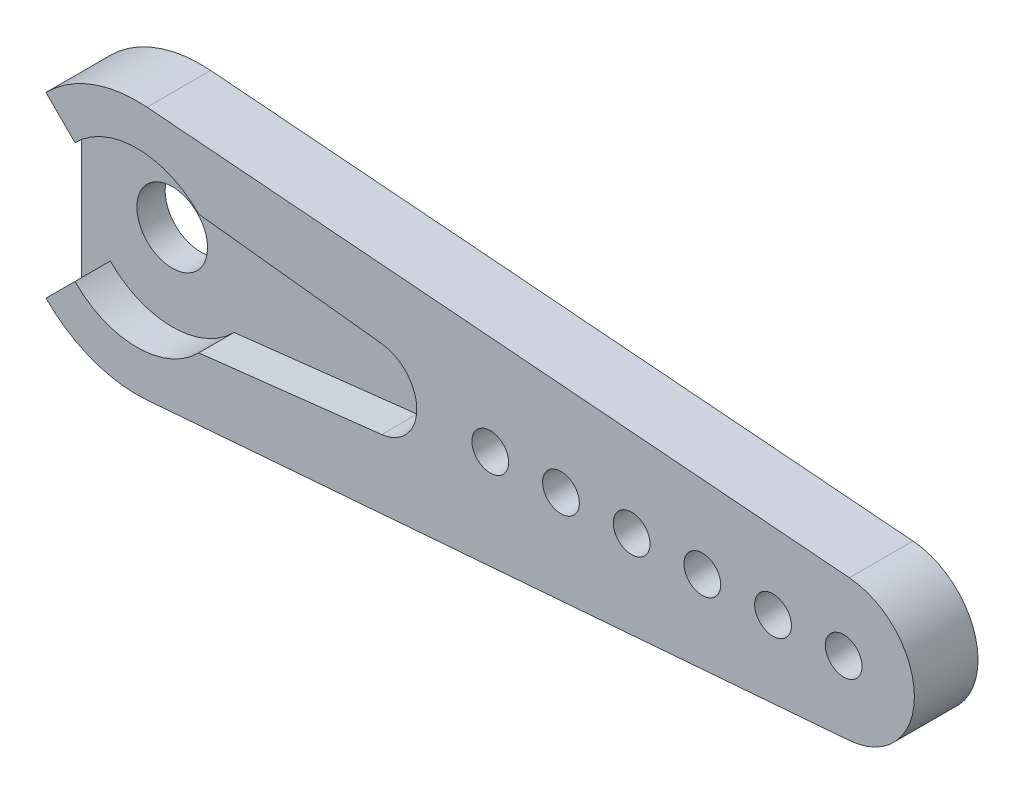
ISO-10303-21;
HEADER;
FILE_DESCRIPTION(('STEP AP214'),'2;1');
FILE_NAME('part.step','',(''),(''),'','','');
FILE_SCHEMA(('AUTOMOTIVE_DESIGN { 1 0 10303 214 1 1 1 1 }'));
ENDSEC;
DATA;
#1=APPLICATION_CONTEXT('core data for automotive mechanical design processes');
#2=APPLICATION_PROTOCOL_DEFINITION('international standard','automotive_design',2000,#1);
#3=PRODUCT_CONTEXT('',#1,'mechanical');
#4=PRODUCT('Part','Part','',(#3));
#5=PRODUCT_RELATED_PRODUCT_CATEGORY('part','',(#4));
#6=PRODUCT_DEFINITION_FORMATION('','',#4);
#7=PRODUCT_DEFINITION_CONTEXT('part definition',#1,'design');
#8=PRODUCT_DEFINITION('design','',#6,#7);
#9=PRODUCT_DEFINITION_SHAPE('','',#8);
#10=(LENGTH_UNIT() NAMED_UNIT(*) SI_UNIT(.MILLI.,.METRE.));
#11=(NAMED_UNIT(*) PLANE_ANGLE_UNIT() SI_UNIT($,.RADIAN.));
#12=(NAMED_UNIT(*) SI_UNIT($,.STERADIAN.) SOLID_ANGLE_UNIT());
#13=UNCERTAINTY_MEASURE_WITH_UNIT(LENGTH_MEASURE(1.E-05),#10,'distance_accuracy_value','');
#14=(GEOMETRIC_REPRESENTATION_CONTEXT(3) GLOBAL_UNCERTAINTY_ASSIGNED_CONTEXT((#13)) GLOBAL_UNIT_ASSIGNED_CONTEXT((#10,
#11,#12)) REPRESENTATION_CONTEXT('',''));
#15=CARTESIAN_POINT('',(0.,0.,0.));
#16=DIRECTION('',(0.,0.,1.));
#17=DIRECTION('',(1.,0.,0.));
#18=AXIS2_PLACEMENT_3D('',#15,#16,#17);
#19=CARTESIAN_POINT('',(25.,0.,-2.));
#20=DIRECTION('',(0.,0.,1.));
#21=DIRECTION('',(1.,0.,0.));
#22=AXIS2_PLACEMENT_3D('',#19,#20,#21);
#23=CYLINDRICAL_SURFACE('',#22,1.3);
#24=CARTESIAN_POINT('',(25.,0.,-2.));
#25=DIRECTION('',(0.,0.,1.));
#26=DIRECTION('',(1.,0.,0.));
#27=AXIS2_PLACEMENT_3D('',#24,#25,#26);
#28=CIRCLE('',#27,1.3);
#29=CARTESIAN_POINT('',(26.3,0.,-2.));
#30=VERTEX_POINT('',#29);
#31=EDGE_CURVE('E40',#30,#30,#28,.T.);
#32=ORIENTED_EDGE('',*,*,#31,.F.);
#33=EDGE_LOOP('',(#32));
#34=FACE_BOUND('',#33,.T.);
#35=CARTESIAN_POINT('',(25.,0.,2.5));
#36=DIRECTION('',(0.,0.,1.));
#37=DIRECTION('',(1.,0.,0.));
#38=AXIS2_PLACEMENT_3D('',#35,#36,#37);
#39=CIRCLE('',#38,1.3);
#40=CARTESIAN_POINT('',(26.3,0.,2.5));
#41=VERTEX_POINT('',#40);
#42=EDGE_CURVE('E11',#41,#41,#39,.T.);
#43=ORIENTED_EDGE('',*,*,#42,.T.);
#44=EDGE_LOOP('',(#43));
#45=FACE_BOUND('',#44,.T.);
#46=ADVANCED_FACE('F32',(#34,#45),#23,.F.);
#47=CARTESIAN_POINT('',(30.,0.,-2.));
#48=DIRECTION('',(0.,0.,1.));
#49=DIRECTION('',(1.,0.,0.));
#50=AXIS2_PLACEMENT_3D('',#47,#48,#49);
#51=CYLINDRICAL_SURFACE('',#50,1.3);
#52=CARTESIAN_POINT('',(30.,0.,-2.));
#53=DIRECTION('',(0.,0.,1.));
#54=DIRECTION('',(1.,0.,0.));
#55=AXIS2_PLACEMENT_3D('',#52,#53,#54);
#56=CIRCLE('',#55,1.3);
#57=CARTESIAN_POINT('',(31.3,0.,-2.));
#58=VERTEX_POINT('',#57);
#59=EDGE_CURVE('E242',#58,#58,#56,.T.);
#60=ORIENTED_EDGE('',*,*,#59,.F.);
#61=EDGE_LOOP('',(#60));
#62=FACE_BOUND('',#61,.T.);
#63=CARTESIAN_POINT('',(30.,0.,2.5));
#64=DIRECTION('',(0.,0.,1.));
#65=DIRECTION('',(1.,0.,0.));
#66=AXIS2_PLACEMENT_3D('',#63,#64,#65);
#67=CIRCLE('',#66,1.3);
#68=CARTESIAN_POINT('',(31.3,0.,2.5));
#69=VERTEX_POINT('',#68);
#70=EDGE_CURVE('E245',#69,#69,#67,.T.);
#71=ORIENTED_EDGE('',*,*,#70,.T.);
#72=EDGE_LOOP('',(#71));
#73=FACE_BOUND('',#72,.T.);
#74=ADVANCED_FACE('F253',(#62,#73),#51,.F.);
#75=CARTESIAN_POINT('',(35.,0.,-2.));
#76=DIRECTION('',(0.,0.,1.));
#77=DIRECTION('',(1.,0.,0.));
#78=AXIS2_PLACEMENT_3D('',#75,#76,#77);
#79=CYLINDRICAL_SURFACE('',#78,1.3);
#80=CARTESIAN_POINT('',(35.,0.,-2.));
#81=DIRECTION('',(0.,0.,1.));
#82=DIRECTION('',(1.,0.,0.));
#83=AXIS2_PLACEMENT_3D('',#80,#81,#82);
#84=CIRCLE('',#83,1.3);
#85=CARTESIAN_POINT('',(36.3,0.,-2.));
#86=VERTEX_POINT('',#85);
#87=EDGE_CURVE('E236',#86,#86,#84,.T.);
#88=ORIENTED_EDGE('',*,*,#87,.F.);
#89=EDGE_LOOP('',(#88));
#90=FACE_BOUND('',#89,.T.);
#91=CARTESIAN_POINT('',(35.,0.,2.5));
#92=DIRECTION('',(0.,0.,1.));
#93=DIRECTION('',(1.,0.,0.));
#94=AXIS2_PLACEMENT_3D('',#91,#92,#93);
#95=CIRCLE('',#94,1.3);
#96=CARTESIAN_POINT('',(36.3,0.,2.5));
#97=VERTEX_POINT('',#96);
#98=EDGE_CURVE('E239',#97,#97,#95,.T.);
#99=ORIENTED_EDGE('',*,*,#98,.T.);
#100=EDGE_LOOP('',(#99));
#101=FACE_BOUND('',#100,.T.);
#102=ADVANCED_FACE('F320',(#90,#101),#79,.F.);
#103=CARTESIAN_POINT('',(40.,0.,-2.));
#104=DIRECTION('',(0.,0.,1.));
#105=DIRECTION('',(1.,0.,0.));
#106=AXIS2_PLACEMENT_3D('',#103,#104,#105);
#107=CYLINDRICAL_SURFACE('',#106,1.3);
#108=CARTESIAN_POINT('',(40.,0.,-2.));
#109=DIRECTION('',(0.,0.,1.));
#110=DIRECTION('',(1.,0.,0.));
#111=AXIS2_PLACEMENT_3D('',#108,#109,#110);
#112=CIRCLE('',#111,1.3);
#113=CARTESIAN_POINT('',(41.3,0.,-2.));
#114=VERTEX_POINT('',#113);
#115=EDGE_CURVE('E230',#114,#114,#112,.T.);
#116=ORIENTED_EDGE('',*,*,#115,.F.);
#117=EDGE_LOOP('',(#116));
#118=FACE_BOUND('',#117,.T.);
#119=CARTESIAN_POINT('',(40.,0.,2.5));
#120=DIRECTION('',(0.,0.,1.));
#121=DIRECTION('',(1.,0.,0.));
#122=AXIS2_PLACEMENT_3D('',#119,#120,#121);
#123=CIRCLE('',#122,1.3);
#124=CARTESIAN_POINT('',(41.3,0.,2.5));
#125=VERTEX_POINT('',#124);
#126=EDGE_CURVE('E233',#125,#125,#123,.T.);
#127=ORIENTED_EDGE('',*,*,#126,.T.);
#128=EDGE_LOOP('',(#127));
#129=FACE_BOUND('',#128,.T.);
#130=ADVANCED_FACE('F316',(#118,#129),#107,.F.);
#131=CARTESIAN_POINT('',(0.,0.,2.5));
#132=DIRECTION('',(0.,0.,-1.));
#133=DIRECTION('',(-1.,0.,0.));
#134=AXIS2_PLACEMENT_3D('',#131,#132,#133);
#135=CYLINDRICAL_SURFACE('',#134,9.);
#136=DIRECTION('',(0.,0.,-1.));
#137=VECTOR('',#136,1.);
#138=CARTESIAN_POINT('',(0.719999999999999,8.97115377195152,2.5));
#139=LINE('',#138,#137);
#140=CARTESIAN_POINT('',(0.719999999999999,8.97115377195152,2.5));
#141=VERTEX_POINT('',#140);
#142=CARTESIAN_POINT('',(0.719999999999999,8.97115377195152,-2.));
#143=VERTEX_POINT('',#142);
#144=EDGE_CURVE('E184',#141,#143,#139,.T.);
#145=ORIENTED_EDGE('',*,*,#144,.T.);
#146=CARTESIAN_POINT('',(0.,0.,-2.));
#147=DIRECTION('',(0.,0.,-1.));
#148=DIRECTION('',(-1.,0.,0.));
#149=AXIS2_PLACEMENT_3D('',#146,#147,#148);
#150=CIRCLE('',#149,9.);
#151=CARTESIAN_POINT('',(-6.42654307097902,6.30075742723457,-2.));
#152=VERTEX_POINT('',#151);
#153=EDGE_CURVE('E134',#152,#143,#150,.T.);
#154=ORIENTED_EDGE('',*,*,#153,.F.);
#155=DIRECTION('',(0.,0.,1.));
#156=VECTOR('',#155,1.);
#157=CARTESIAN_POINT('',(-6.42654307097902,6.30075742723457,-2.));
#158=LINE('',#157,#156);
#159=CARTESIAN_POINT('',(-6.42654307097902,6.30075742723457,0.));
#160=VERTEX_POINT('',#159);
#161=EDGE_CURVE('E130',#152,#160,#158,.T.);
#162=ORIENTED_EDGE('',*,*,#161,.T.);
#163=DIRECTION('',(0.,0.,-1.));
#164=VECTOR('',#163,1.);
#165=CARTESIAN_POINT('',(-6.42654307097901,6.30075742723457,2.5));
#166=LINE('',#165,#164);
#167=CARTESIAN_POINT('',(-6.42654307097901,6.30075742723457,2.5));
#168=VERTEX_POINT('',#167);
#169=EDGE_CURVE('E227',#168,#160,#166,.T.);
#170=ORIENTED_EDGE('',*,*,#169,.F.);
#171=CARTESIAN_POINT('',(0.,0.,2.5));
#172=DIRECTION('',(0.,0.,1.));
#173=DIRECTION('',(-1.,0.,0.));
#174=AXIS2_PLACEMENT_3D('',#171,#172,#173);
#175=CIRCLE('',#174,9.);
#176=EDGE_CURVE('E161',#141,#168,#175,.T.);
#177=ORIENTED_EDGE('',*,*,#176,.F.);
#178=EDGE_LOOP('',(#145,#154,#162,#170,#177));
#179=FACE_BOUND('',#178,.T.);
#180=ADVANCED_FACE('F312',(#179),#135,.T.);
#181=CARTESIAN_POINT('',(-4.37578564374445,4.25,2.5));
#182=DIRECTION('',(0.707106781186548,0.707106781186548,0.));
#183=DIRECTION('',(-0.707106781186548,0.707106781186548,0.));
#184=AXIS2_PLACEMENT_3D('',#181,#182,#183);
#185=PLANE('',#184);
#186=DIRECTION('',(0.707106781186548,-0.707106781186548,0.));
#187=VECTOR('',#186,1.);
#188=CARTESIAN_POINT('',(-4.37578564374445,4.25,0.));
#189=LINE('',#188,#187);
#190=CARTESIAN_POINT('',(-4.37578564374445,4.25,0.));
#191=VERTEX_POINT('',#190);
#192=EDGE_CURVE('E153',#160,#191,#189,.T.);
#193=ORIENTED_EDGE('',*,*,#192,.T.);
#194=DIRECTION('',(0.,0.,-1.));
#195=VECTOR('',#194,1.);
#196=CARTESIAN_POINT('',(-4.37578564374445,4.25,2.5));
#197=LINE('',#196,#195);
#198=CARTESIAN_POINT('',(-4.37578564374445,4.25,2.5));
#199=VERTEX_POINT('',#198);
#200=EDGE_CURVE('E224',#199,#191,#197,.T.);
#201=ORIENTED_EDGE('',*,*,#200,.F.);
#202=DIRECTION('',(0.707106781186548,-0.707106781186548,0.));
#203=VECTOR('',#202,1.);
#204=CARTESIAN_POINT('',(-4.37578564374445,4.25,2.5));
#205=LINE('',#204,#203);
#206=EDGE_CURVE('E163',#168,#199,#205,.T.);
#207=ORIENTED_EDGE('',*,*,#206,.F.);
#208=ORIENTED_EDGE('',*,*,#169,.T.);
#209=EDGE_LOOP('',(#193,#201,#207,#208));
#210=FACE_BOUND('',#209,.T.);
#211=ADVANCED_FACE('F308',(#210),#185,.F.);
#212=CARTESIAN_POINT('',(0.,0.,2.5));
#213=DIRECTION('',(0.,0.,-1.));
#214=DIRECTION('',(-1.,0.,0.));
#215=AXIS2_PLACEMENT_3D('',#212,#213,#214);
#216=CYLINDRICAL_SURFACE('',#215,6.1);
#217=CARTESIAN_POINT('',(0.,0.,0.));
#218=DIRECTION('',(0.,0.,-1.));
#219=DIRECTION('',(1.,0.,0.));
#220=AXIS2_PLACEMENT_3D('',#217,#218,#219);
#221=CIRCLE('',#220,6.1);
#222=CARTESIAN_POINT('',(4.37578564374445,4.25,0.));
#223=VERTEX_POINT('',#222);
#224=EDGE_CURVE('E156',#191,#223,#221,.T.);
#225=ORIENTED_EDGE('',*,*,#224,.T.);
#226=DIRECTION('',(0.,0.,-1.));
#227=VECTOR('',#226,1.);
#228=CARTESIAN_POINT('',(4.37578564374445,4.25,2.5));
#229=LINE('',#228,#227);
#230=CARTESIAN_POINT('',(4.37578564374445,4.25,2.5));
#231=VERTEX_POINT('',#230);
#232=EDGE_CURVE('E221',#231,#223,#229,.T.);
#233=ORIENTED_EDGE('',*,*,#232,.F.);
#234=CARTESIAN_POINT('',(0.,0.,2.5));
#235=DIRECTION('',(0.,0.,-1.));
#236=DIRECTION('',(1.,0.,0.));
#237=AXIS2_PLACEMENT_3D('',#234,#235,#236);
#238=CIRCLE('',#237,6.1);
#239=EDGE_CURVE('E166',#199,#231,#238,.T.);
#240=ORIENTED_EDGE('',*,*,#239,.F.);
#241=ORIENTED_EDGE('',*,*,#200,.T.);
#242=EDGE_LOOP('',(#225,#233,#240,#241));
#243=FACE_BOUND('',#242,.T.);
#244=ADVANCED_FACE('F304',(#243),#216,.F.);
#245=CARTESIAN_POINT('',(4.37578564374445,4.25,2.5));
#246=DIRECTION('',(0.112713317991759,0.993627549913592,0.));
#247=DIRECTION('',(-0.993627549913592,0.112713317991759,0.));
#248=AXIS2_PLACEMENT_3D('',#245,#246,#247);
#249=PLANE('',#248);
#250=DIRECTION('',(0.993627549913592,-0.112713317991759,0.));
#251=VECTOR('',#250,1.);
#252=CARTESIAN_POINT('',(4.37578564374445,4.25,0.));
#253=LINE('',#252,#251);
#254=CARTESIAN_POINT('',(17.3155972903769,2.78215713975806,0.));
#255=VERTEX_POINT('',#254);
#256=EDGE_CURVE('E188',#223,#255,#253,.T.);
#257=ORIENTED_EDGE('',*,*,#256,.T.);
#258=DIRECTION('',(0.,0.,-1.));
#259=VECTOR('',#258,1.);
#260=CARTESIAN_POINT('',(17.3155972903769,2.78215713975806,2.5));
#261=LINE('',#260,#259);
#262=CARTESIAN_POINT('',(17.3155972903769,2.78215713975806,2.5));
#263=VERTEX_POINT('',#262);
#264=EDGE_CURVE('E218',#263,#255,#261,.T.);
#265=ORIENTED_EDGE('',*,*,#264,.F.);
#266=DIRECTION('',(0.993627549913592,-0.112713317991759,0.));
#267=VECTOR('',#266,1.);
#268=CARTESIAN_POINT('',(4.37578564374445,4.25,2.5));
#269=LINE('',#268,#267);
#270=EDGE_CURVE('E168',#231,#263,#269,.T.);
#271=ORIENTED_EDGE('',*,*,#270,.F.);
#272=ORIENTED_EDGE('',*,*,#232,.T.);
#273=EDGE_LOOP('',(#257,#265,#271,#272));
#274=FACE_BOUND('',#273,.T.);
#275=ADVANCED_FACE('F300',(#274),#249,.F.);
#276=CARTESIAN_POINT('',(17.,0.,2.5));
#277=DIRECTION('',(0.,0.,-1.));
#278=DIRECTION('',(-1.,0.,0.));
#279=AXIS2_PLACEMENT_3D('',#276,#277,#278);
#280=CYLINDRICAL_SURFACE('',#279,2.8);
#281=CARTESIAN_POINT('',(17.,0.,0.));
#282=DIRECTION('',(0.,0.,-1.));
#283=DIRECTION('',(1.,0.,0.));
#284=AXIS2_PLACEMENT_3D('',#281,#282,#283);
#285=CIRCLE('',#284,2.8);
#286=CARTESIAN_POINT('',(17.3155972903769,-2.78215713975806,0.));
#287=VERTEX_POINT('',#286);
#288=EDGE_CURVE('E191',#255,#287,#285,.T.);
#289=ORIENTED_EDGE('',*,*,#288,.T.);
#290=DIRECTION('',(0.,0.,-1.));
#291=VECTOR('',#290,1.);
#292=CARTESIAN_POINT('',(17.3155972903769,-2.78215713975806,2.5));
#293=LINE('',#292,#291);
#294=CARTESIAN_POINT('',(17.3155972903769,-2.78215713975806,2.5));
#295=VERTEX_POINT('',#294);
#296=EDGE_CURVE('E215',#295,#287,#293,.T.);
#297=ORIENTED_EDGE('',*,*,#296,.F.);
#298=CARTESIAN_POINT('',(17.,0.,2.5));
#299=DIRECTION('',(0.,0.,-1.));
#300=DIRECTION('',(1.,0.,0.));
#301=AXIS2_PLACEMENT_3D('',#298,#299,#300);
#302=CIRCLE('',#301,2.8);
#303=EDGE_CURVE('E170',#263,#295,#302,.T.);
#304=ORIENTED_EDGE('',*,*,#303,.F.);
#305=ORIENTED_EDGE('',*,*,#264,.T.);
#306=EDGE_LOOP('',(#289,#297,#304,#305));
#307=FACE_BOUND('',#306,.T.);
#308=ADVANCED_FACE('F296',(#307),#280,.F.);
#309=CARTESIAN_POINT('',(17.3155972903769,-2.78215713975806,2.5));
#310=DIRECTION('',(0.112713317991759,-0.993627549913592,0.));
#311=DIRECTION('',(0.993627549913592,0.112713317991759,0.));
#312=AXIS2_PLACEMENT_3D('',#309,#310,#311);
#313=PLANE('',#312);
#314=DIRECTION('',(-0.993627549913592,-0.112713317991759,0.));
#315=VECTOR('',#314,1.);
#316=CARTESIAN_POINT('',(17.3155972903769,-2.78215713975806,0.));
#317=LINE('',#316,#315);
#318=CARTESIAN_POINT('',(4.37578564374445,-4.25,0.));
#319=VERTEX_POINT('',#318);
#320=EDGE_CURVE('E194',#287,#319,#317,.T.);
#321=ORIENTED_EDGE('',*,*,#320,.T.);
#322=DIRECTION('',(0.,0.,-1.));
#323=VECTOR('',#322,1.);
#324=CARTESIAN_POINT('',(4.37578564374445,-4.25,2.5));
#325=LINE('',#324,#323);
#326=CARTESIAN_POINT('',(4.37578564374445,-4.25,2.5));
#327=VERTEX_POINT('',#326);
#328=EDGE_CURVE('E212',#327,#319,#325,.T.);
#329=ORIENTED_EDGE('',*,*,#328,.F.);
#330=DIRECTION('',(-0.993627549913592,-0.112713317991759,0.));
#331=VECTOR('',#330,1.);
#332=CARTESIAN_POINT('',(17.3155972903769,-2.78215713975806,2.5));
#333=LINE('',#332,#331);
#334=EDGE_CURVE('E172',#295,#327,#333,.T.);
#335=ORIENTED_EDGE('',*,*,#334,.F.);
#336=ORIENTED_EDGE('',*,*,#296,.T.);
#337=EDGE_LOOP('',(#321,#329,#335,#336));
#338=FACE_BOUND('',#337,.T.);
#339=ADVANCED_FACE('F292',(#338),#313,.F.);
#340=CARTESIAN_POINT('',(0.,0.,2.5));
#341=DIRECTION('',(0.,0.,-1.));
#342=DIRECTION('',(-1.,0.,0.));
#343=AXIS2_PLACEMENT_3D('',#340,#341,#342);
#344=CYLINDRICAL_SURFACE('',#343,6.1);
#345=CARTESIAN_POINT('',(0.,0.,0.));
#346=DIRECTION('',(0.,0.,-1.));
#347=DIRECTION('',(-1.,0.,0.));
#348=AXIS2_PLACEMENT_3D('',#345,#346,#347);
#349=CIRCLE('',#348,6.1);
#350=CARTESIAN_POINT('',(-4.37578564374444,-4.25,0.));
#351=VERTEX_POINT('',#350);
#352=EDGE_CURVE('E197',#319,#351,#349,.T.);
#353=ORIENTED_EDGE('',*,*,#352,.T.);
#354=DIRECTION('',(0.,0.,-1.));
#355=VECTOR('',#354,1.);
#356=CARTESIAN_POINT('',(-4.37578564374444,-4.25,2.5));
#357=LINE('',#356,#355);
#358=CARTESIAN_POINT('',(-4.37578564374444,-4.25,2.5));
#359=VERTEX_POINT('',#358);
#360=EDGE_CURVE('E209',#359,#351,#357,.T.);
#361=ORIENTED_EDGE('',*,*,#360,.F.);
#362=CARTESIAN_POINT('',(0.,0.,2.5));
#363=DIRECTION('',(0.,0.,-1.));
#364=DIRECTION('',(-1.,0.,0.));
#365=AXIS2_PLACEMENT_3D('',#362,#363,#364);
#366=CIRCLE('',#365,6.1);
#367=EDGE_CURVE('E174',#327,#359,#366,.T.);
#368=ORIENTED_EDGE('',*,*,#367,.F.);
#369=ORIENTED_EDGE('',*,*,#328,.T.);
#370=EDGE_LOOP('',(#353,#361,#368,#369));
#371=FACE_BOUND('',#370,.T.);
#372=ADVANCED_FACE('F288',(#371),#344,.F.);
#373=CARTESIAN_POINT('',(-4.37578564374445,-4.25,2.5));
#374=DIRECTION('',(0.707106781186548,-0.707106781186548,0.));
#375=DIRECTION('',(0.707106781186548,0.707106781186548,0.));
#376=AXIS2_PLACEMENT_3D('',#373,#374,#375);
#377=PLANE('',#376);
#378=DIRECTION('',(-0.707106781186548,-0.707106781186548,0.));
#379=VECTOR('',#378,1.);
#380=CARTESIAN_POINT('',(-4.37578564374445,-4.25,0.));
#381=LINE('',#380,#379);
#382=CARTESIAN_POINT('',(-6.42654307097901,-6.30075742723457,0.));
#383=VERTEX_POINT('',#382);
#384=EDGE_CURVE('E164',#351,#383,#381,.T.);
#385=ORIENTED_EDGE('',*,*,#384,.T.);
#386=DIRECTION('',(0.,0.,-1.));
#387=VECTOR('',#386,1.);
#388=CARTESIAN_POINT('',(-6.42654307097901,-6.30075742723457,2.5));
#389=LINE('',#388,#387);
#390=CARTESIAN_POINT('',(-6.42654307097901,-6.30075742723457,2.5));
#391=VERTEX_POINT('',#390);
#392=EDGE_CURVE('E152',#391,#383,#389,.T.);
#393=ORIENTED_EDGE('',*,*,#392,.F.);
#394=DIRECTION('',(-0.707106781186548,-0.707106781186548,0.));
#395=VECTOR('',#394,1.);
#396=CARTESIAN_POINT('',(-4.37578564374445,-4.25,2.5));
#397=LINE('',#396,#395);
#398=EDGE_CURVE('E176',#359,#391,#397,.T.);
#399=ORIENTED_EDGE('',*,*,#398,.F.);
#400=ORIENTED_EDGE('',*,*,#360,.T.);
#401=EDGE_LOOP('',(#385,#393,#399,#400));
#402=FACE_BOUND('',#401,.T.);
#403=ADVANCED_FACE('F285',(#402),#377,.F.);
#404=CARTESIAN_POINT('',(0.,0.,2.5));
#405=DIRECTION('',(0.,0.,-1.));
#406=DIRECTION('',(-1.,0.,0.));
#407=AXIS2_PLACEMENT_3D('',#404,#405,#406);
#408=CYLINDRICAL_SURFACE('',#407,9.);
#409=ORIENTED_EDGE('',*,*,#392,.T.);
#410=DIRECTION('',(0.,0.,1.));
#411=VECTOR('',#410,1.);
#412=CARTESIAN_POINT('',(-6.42654307097901,-6.30075742723457,-2.));
#413=LINE('',#412,#411);
#414=CARTESIAN_POINT('',(-6.42654307097901,-6.30075742723457,-2.));
#415=VERTEX_POINT('',#414);
#416=EDGE_CURVE('E127',#415,#383,#413,.T.);
#417=ORIENTED_EDGE('',*,*,#416,.F.);
#418=CARTESIAN_POINT('',(0.,0.,-2.));
#419=DIRECTION('',(0.,0.,-1.));
#420=DIRECTION('',(-1.,0.,0.));
#421=AXIS2_PLACEMENT_3D('',#418,#419,#420);
#422=CIRCLE('',#421,9.);
#423=CARTESIAN_POINT('',(0.72,-8.97115377195152,-2.));
#424=VERTEX_POINT('',#423);
#425=EDGE_CURVE('E135',#424,#415,#422,.T.);
#426=ORIENTED_EDGE('',*,*,#425,.F.);
#427=DIRECTION('',(0.,0.,-1.));
#428=VECTOR('',#427,1.);
#429=CARTESIAN_POINT('',(0.719999999999997,-8.97115377195152,2.5));
#430=LINE('',#429,#428);
#431=CARTESIAN_POINT('',(0.719999999999997,-8.97115377195152,2.5));
#432=VERTEX_POINT('',#431);
#433=EDGE_CURVE('E206',#432,#424,#430,.T.);
#434=ORIENTED_EDGE('',*,*,#433,.F.);
#435=CARTESIAN_POINT('',(0.,0.,2.5));
#436=DIRECTION('',(0.,0.,1.));
#437=DIRECTION('',(1.,0.,0.));
#438=AXIS2_PLACEMENT_3D('',#435,#436,#437);
#439=CIRCLE('',#438,9.);
#440=EDGE_CURVE('E178',#391,#432,#439,.T.);
#441=ORIENTED_EDGE('',*,*,#440,.F.);
#442=EDGE_LOOP('',(#409,#417,#426,#434,#441));
#443=FACE_BOUND('',#442,.T.);
#444=ADVANCED_FACE('F149',(#443),#408,.T.);
#445=CARTESIAN_POINT('',(0.72,-8.97115377195152,2.5));
#446=DIRECTION('',(-0.08,0.996794863550169,0.));
#447=DIRECTION('',(-0.996794863550169,-0.08,0.));
#448=AXIS2_PLACEMENT_3D('',#445,#446,#447);
#449=PLANE('',#448);
#450=ORIENTED_EDGE('',*,*,#433,.T.);
#451=DIRECTION('',(-0.996794863550169,-0.08,0.));
#452=VECTOR('',#451,1.);
#453=CARTESIAN_POINT('',(0.72,-8.97115377195152,-2.));
#454=LINE('',#453,#452);
#455=CARTESIAN_POINT('',(50.4,-4.98397431775085,-2.));
#456=VERTEX_POINT('',#455);
#457=EDGE_CURVE('E143',#456,#424,#454,.T.);
#458=ORIENTED_EDGE('',*,*,#457,.F.);
#459=DIRECTION('',(0.,0.,-1.));
#460=VECTOR('',#459,1.);
#461=CARTESIAN_POINT('',(50.4,-4.98397431775085,2.5));
#462=LINE('',#461,#460);
#463=CARTESIAN_POINT('',(50.4,-4.98397431775085,2.5));
#464=VERTEX_POINT('',#463);
#465=EDGE_CURVE('E204',#464,#456,#462,.T.);
#466=ORIENTED_EDGE('',*,*,#465,.F.);
#467=DIRECTION('',(0.996794863550169,0.08,0.));
#468=VECTOR('',#467,1.);
#469=CARTESIAN_POINT('',(0.72,-8.97115377195152,2.5));
#470=LINE('',#469,#468);
#471=EDGE_CURVE('E180',#432,#464,#470,.T.);
#472=ORIENTED_EDGE('',*,*,#471,.F.);
#473=EDGE_LOOP('',(#450,#458,#466,#472));
#474=FACE_BOUND('',#473,.T.);
#475=ADVANCED_FACE('F278',(#474),#449,.F.);
#476=CARTESIAN_POINT('',(50.,0.,2.5));
#477=DIRECTION('',(0.,0.,-1.));
#478=DIRECTION('',(-1.,0.,0.));
#479=AXIS2_PLACEMENT_3D('',#476,#477,#478);
#480=CYLINDRICAL_SURFACE('',#479,5.);
#481=ORIENTED_EDGE('',*,*,#465,.T.);
#482=CARTESIAN_POINT('',(50.,0.,-2.));
#483=DIRECTION('',(0.,0.,-1.));
#484=DIRECTION('',(-1.,0.,0.));
#485=AXIS2_PLACEMENT_3D('',#482,#483,#484);
#486=CIRCLE('',#485,5.);
#487=CARTESIAN_POINT('',(50.4,4.98397431775085,-2.));
#488=VERTEX_POINT('',#487);
#489=EDGE_CURVE('E525',#488,#456,#486,.T.);
#490=ORIENTED_EDGE('',*,*,#489,.F.);
#491=DIRECTION('',(0.,0.,-1.));
#492=VECTOR('',#491,1.);
#493=CARTESIAN_POINT('',(50.4,4.98397431775085,2.5));
#494=LINE('',#493,#492);
#495=CARTESIAN_POINT('',(50.4,4.98397431775085,2.5));
#496=VERTEX_POINT('',#495);
#497=EDGE_CURVE('E202',#496,#488,#494,.T.);
#498=ORIENTED_EDGE('',*,*,#497,.F.);
#499=CARTESIAN_POINT('',(50.,0.,2.5));
#500=DIRECTION('',(0.,0.,1.));
#501=DIRECTION('',(-1.,0.,0.));
#502=AXIS2_PLACEMENT_3D('',#499,#500,#501);
#503=CIRCLE('',#502,5.);
#504=EDGE_CURVE('E182',#464,#496,#503,.T.);
#505=ORIENTED_EDGE('',*,*,#504,.F.);
#506=EDGE_LOOP('',(#481,#490,#498,#505));
#507=FACE_BOUND('',#506,.T.);
#508=ADVANCED_FACE('F268',(#507),#480,.T.);
#509=CARTESIAN_POINT('',(0.719999999999999,8.97115377195152,2.5));
#510=DIRECTION('',(-0.08,-0.996794863550169,0.));
#511=DIRECTION('',(0.996794863550169,-0.08,0.));
#512=AXIS2_PLACEMENT_3D('',#509,#510,#511);
#513=PLANE('',#512);
#514=ORIENTED_EDGE('',*,*,#497,.T.);
#515=DIRECTION('',(0.996794863550169,-0.08,0.));
#516=VECTOR('',#515,1.);
#517=CARTESIAN_POINT('',(0.719999999999999,8.97115377195152,-2.));
#518=LINE('',#517,#516);
#519=EDGE_CURVE('E522',#143,#488,#518,.T.);
#520=ORIENTED_EDGE('',*,*,#519,.F.);
#521=ORIENTED_EDGE('',*,*,#144,.F.);
#522=DIRECTION('',(-0.996794863550169,0.08,0.));
#523=VECTOR('',#522,1.);
#524=CARTESIAN_POINT('',(0.719999999999999,8.97115377195152,2.5));
#525=LINE('',#524,#523);
#526=EDGE_CURVE('E47',#496,#141,#525,.T.);
#527=ORIENTED_EDGE('',*,*,#526,.F.);
#528=EDGE_LOOP('',(#514,#520,#521,#527));
#529=FACE_BOUND('',#528,.T.);
#530=ADVANCED_FACE('F258',(#529),#513,.F.);
#531=CARTESIAN_POINT('',(0.,0.,2.5));
#532=DIRECTION('',(0.,0.,-1.));
#533=DIRECTION('',(-1.,0.,0.));
#534=AXIS2_PLACEMENT_3D('',#531,#532,#533);
#535=PLANE('',#534);
#536=CARTESIAN_POINT('',(45.,0.,2.5));
#537=DIRECTION('',(0.,0.,1.));
#538=DIRECTION('',(1.,0.,0.));
#539=AXIS2_PLACEMENT_3D('',#536,#537,#538);
#540=CIRCLE('',#539,1.3);
#541=CARTESIAN_POINT('',(46.3,0.,2.5));
#542=VERTEX_POINT('',#541);
#543=EDGE_CURVE('E505',#542,#542,#540,.T.);
#544=ORIENTED_EDGE('',*,*,#543,.F.);
#545=EDGE_LOOP('',(#544));
#546=FACE_BOUND('',#545,.T.);
#547=CARTESIAN_POINT('',(50.,0.,2.5));
#548=DIRECTION('',(0.,0.,1.));
#549=DIRECTION('',(1.,0.,0.));
#550=AXIS2_PLACEMENT_3D('',#547,#548,#549);
#551=CIRCLE('',#550,1.3);
#552=CARTESIAN_POINT('',(51.3,0.,2.5));
#553=VERTEX_POINT('',#552);
#554=EDGE_CURVE('E506',#553,#553,#551,.T.);
#555=ORIENTED_EDGE('',*,*,#554,.F.);
#556=EDGE_LOOP('',(#555));
#557=FACE_BOUND('',#556,.T.);
#558=ORIENTED_EDGE('',*,*,#176,.T.);
#559=ORIENTED_EDGE('',*,*,#206,.T.);
#560=ORIENTED_EDGE('',*,*,#239,.T.);
#561=ORIENTED_EDGE('',*,*,#270,.T.);
#562=ORIENTED_EDGE('',*,*,#303,.T.);
#563=ORIENTED_EDGE('',*,*,#334,.T.);
#564=ORIENTED_EDGE('',*,*,#367,.T.);
#565=ORIENTED_EDGE('',*,*,#398,.T.);
#566=ORIENTED_EDGE('',*,*,#440,.T.);
#567=ORIENTED_EDGE('',*,*,#471,.T.);
#568=ORIENTED_EDGE('',*,*,#504,.T.);
#569=ORIENTED_EDGE('',*,*,#526,.T.);
#570=EDGE_LOOP('',(#558,#559,#560,#561,#562,#563,#564,#565,#566,#567,#568,#569));
#571=FACE_BOUND('',#570,.T.);
#572=ORIENTED_EDGE('',*,*,#126,.F.);
#573=EDGE_LOOP('',(#572));
#574=FACE_BOUND('',#573,.T.);
#575=ORIENTED_EDGE('',*,*,#98,.F.);
#576=EDGE_LOOP('',(#575));
#577=FACE_BOUND('',#576,.T.);
#578=ORIENTED_EDGE('',*,*,#70,.F.);
#579=EDGE_LOOP('',(#578));
#580=FACE_BOUND('',#579,.T.);
#581=ORIENTED_EDGE('',*,*,#42,.F.);
#582=EDGE_LOOP('',(#581));
#583=FACE_BOUND('',#582,.T.);
#584=ADVANCED_FACE('F256',(#546,#557,#571,#574,#577,#580,#583),#535,.F.);
#585=CARTESIAN_POINT('',(0.,0.,-2.));
#586=DIRECTION('',(0.,0.,-1.));
#587=DIRECTION('',(-1.,0.,0.));
#588=AXIS2_PLACEMENT_3D('',#585,#586,#587);
#589=PLANE('',#588);
#590=CARTESIAN_POINT('',(45.,0.,-2.));
#591=DIRECTION('',(0.,0.,1.));
#592=DIRECTION('',(1.,0.,0.));
#593=AXIS2_PLACEMENT_3D('',#590,#591,#592);
#594=CIRCLE('',#593,1.3);
#595=CARTESIAN_POINT('',(46.3,0.,-2.));
#596=VERTEX_POINT('',#595);
#597=EDGE_CURVE('E503',#596,#596,#594,.T.);
#598=ORIENTED_EDGE('',*,*,#597,.T.);
#599=EDGE_LOOP('',(#598));
#600=FACE_BOUND('',#599,.T.);
#601=CARTESIAN_POINT('',(50.,0.,-2.));
#602=DIRECTION('',(0.,0.,1.));
#603=DIRECTION('',(1.,0.,0.));
#604=AXIS2_PLACEMENT_3D('',#601,#602,#603);
#605=CIRCLE('',#604,1.3);
#606=CARTESIAN_POINT('',(51.3,0.,-2.));
#607=VERTEX_POINT('',#606);
#608=EDGE_CURVE('E509',#607,#607,#605,.T.);
#609=ORIENTED_EDGE('',*,*,#608,.T.);
#610=EDGE_LOOP('',(#609));
#611=FACE_BOUND('',#610,.T.);
#612=ORIENTED_EDGE('',*,*,#425,.T.);
#613=DIRECTION('',(0.,1.,0.));
#614=VECTOR('',#613,1.);
#615=CARTESIAN_POINT('',(-6.42654307097901,-6.30075742723457,-2.));
#616=LINE('',#615,#614);
#617=EDGE_CURVE('E122',#415,#152,#616,.T.);
#618=ORIENTED_EDGE('',*,*,#617,.T.);
#619=ORIENTED_EDGE('',*,*,#153,.T.);
#620=ORIENTED_EDGE('',*,*,#519,.T.);
#621=ORIENTED_EDGE('',*,*,#489,.T.);
#622=ORIENTED_EDGE('',*,*,#457,.T.);
#623=EDGE_LOOP('',(#612,#618,#619,#620,#621,#622));
#624=FACE_BOUND('',#623,.T.);
#625=CARTESIAN_POINT('',(0.,0.,-2.));
#626=DIRECTION('',(0.,0.,-1.));
#627=DIRECTION('',(-1.,0.,0.));
#628=AXIS2_PLACEMENT_3D('',#625,#626,#627);
#629=CIRCLE('',#628,2.5);
#630=CARTESIAN_POINT('',(-2.5,0.,-2.));
#631=VERTEX_POINT('',#630);
#632=EDGE_CURVE('E516',#631,#631,#629,.T.);
#633=ORIENTED_EDGE('',*,*,#632,.F.);
#634=EDGE_LOOP('',(#633));
#635=FACE_BOUND('',#634,.T.);
#636=ORIENTED_EDGE('',*,*,#115,.T.);
#637=EDGE_LOOP('',(#636));
#638=FACE_BOUND('',#637,.T.);
#639=ORIENTED_EDGE('',*,*,#87,.T.);
#640=EDGE_LOOP('',(#639));
#641=FACE_BOUND('',#640,.T.);
#642=ORIENTED_EDGE('',*,*,#59,.T.);
#643=EDGE_LOOP('',(#642));
#644=FACE_BOUND('',#643,.T.);
#645=ORIENTED_EDGE('',*,*,#31,.T.);
#646=EDGE_LOOP('',(#645));
#647=FACE_BOUND('',#646,.T.);
#648=ADVANCED_FACE('F139',(#600,#611,#624,#635,#638,#641,#644,#647),#589,.T.);
#649=CARTESIAN_POINT('',(0.,0.,0.));
#650=DIRECTION('',(0.,0.,-1.));
#651=DIRECTION('',(-1.,0.,0.));
#652=AXIS2_PLACEMENT_3D('',#649,#650,#651);
#653=PLANE('',#652);
#654=ORIENTED_EDGE('',*,*,#384,.F.);
#655=ORIENTED_EDGE('',*,*,#352,.F.);
#656=ORIENTED_EDGE('',*,*,#320,.F.);
#657=ORIENTED_EDGE('',*,*,#288,.F.);
#658=ORIENTED_EDGE('',*,*,#256,.F.);
#659=ORIENTED_EDGE('',*,*,#224,.F.);
#660=ORIENTED_EDGE('',*,*,#192,.F.);
#661=DIRECTION('',(0.,1.,0.));
#662=VECTOR('',#661,1.);
#663=CARTESIAN_POINT('',(-6.42654307097901,-6.30075742723457,0.));
#664=LINE('',#663,#662);
#665=EDGE_CURVE('E146',#383,#160,#664,.T.);
#666=ORIENTED_EDGE('',*,*,#665,.F.);
#667=EDGE_LOOP('',(#654,#655,#656,#657,#658,#659,#660,#666));
#668=FACE_BOUND('',#667,.T.);
#669=CARTESIAN_POINT('',(0.,0.,0.));
#670=DIRECTION('',(0.,0.,-1.));
#671=DIRECTION('',(-1.,0.,0.));
#672=AXIS2_PLACEMENT_3D('',#669,#670,#671);
#673=CIRCLE('',#672,2.5);
#674=CARTESIAN_POINT('',(-2.5,0.,0.));
#675=VERTEX_POINT('',#674);
#676=EDGE_CURVE('E514',#675,#675,#673,.T.);
#677=ORIENTED_EDGE('',*,*,#676,.T.);
#678=EDGE_LOOP('',(#677));
#679=FACE_BOUND('',#678,.T.);
#680=ADVANCED_FACE('F265',(#668,#679),#653,.F.);
#681=CARTESIAN_POINT('',(-6.42654307097901,-6.30075742723457,-2.));
#682=DIRECTION('',(1.,0.,0.));
#683=DIRECTION('',(0.,0.,-1.));
#684=AXIS2_PLACEMENT_3D('',#681,#682,#683);
#685=PLANE('',#684);
#686=ORIENTED_EDGE('',*,*,#665,.T.);
#687=ORIENTED_EDGE('',*,*,#161,.F.);
#688=ORIENTED_EDGE('',*,*,#617,.F.);
#689=ORIENTED_EDGE('',*,*,#416,.T.);
#690=EDGE_LOOP('',(#686,#687,#688,#689));
#691=FACE_BOUND('',#690,.T.);
#692=ADVANCED_FACE('F125',(#691),#685,.F.);
#693=CARTESIAN_POINT('',(0.,0.,-2.));
#694=DIRECTION('',(0.,0.,1.));
#695=DIRECTION('',(1.,0.,0.));
#696=AXIS2_PLACEMENT_3D('',#693,#694,#695);
#697=CYLINDRICAL_SURFACE('',#696,2.5);
#698=ORIENTED_EDGE('',*,*,#632,.T.);
#699=EDGE_LOOP('',(#698));
#700=FACE_BOUND('',#699,.T.);
#701=ORIENTED_EDGE('',*,*,#676,.F.);
#702=EDGE_LOOP('',(#701));
#703=FACE_BOUND('',#702,.T.);
#704=ADVANCED_FACE('F410',(#700,#703),#697,.F.);
#705=CARTESIAN_POINT('',(50.,0.,-2.));
#706=DIRECTION('',(0.,0.,1.));
#707=DIRECTION('',(1.,0.,0.));
#708=AXIS2_PLACEMENT_3D('',#705,#706,#707);
#709=CYLINDRICAL_SURFACE('',#708,1.3);
#710=ORIENTED_EDGE('',*,*,#608,.F.);
#711=EDGE_LOOP('',(#710));
#712=FACE_BOUND('',#711,.T.);
#713=ORIENTED_EDGE('',*,*,#554,.T.);
#714=EDGE_LOOP('',(#713));
#715=FACE_BOUND('',#714,.T.);
#716=ADVANCED_FACE('F418',(#712,#715),#709,.F.);
#717=CARTESIAN_POINT('',(45.,0.,-2.));
#718=DIRECTION('',(0.,0.,1.));
#719=DIRECTION('',(1.,0.,0.));
#720=AXIS2_PLACEMENT_3D('',#717,#718,#719);
#721=CYLINDRICAL_SURFACE('',#720,1.3);
#722=ORIENTED_EDGE('',*,*,#597,.F.);
#723=EDGE_LOOP('',(#722));
#724=FACE_BOUND('',#723,.T.);
#725=ORIENTED_EDGE('',*,*,#543,.T.);
#726=EDGE_LOOP('',(#725));
#727=FACE_BOUND('',#726,.T.);
#728=ADVANCED_FACE('F427',(#724,#727),#721,.F.);
#729=CLOSED_SHELL('',(#46,#74,#102,#130,#180,#211,#244,#275,#308,#339,#372,#403,#444,#475,#508,
#530,#584,#648,#680,#692,#704,#716,#728));
#730=MANIFOLD_SOLID_BREP('B2',#729);
#731=ADVANCED_BREP_SHAPE_REPRESENTATION('',(#18,#730),#14);
#732=SHAPE_DEFINITION_REPRESENTATION(#9,#731);
ENDSEC;
END-ISO-10303-21;
